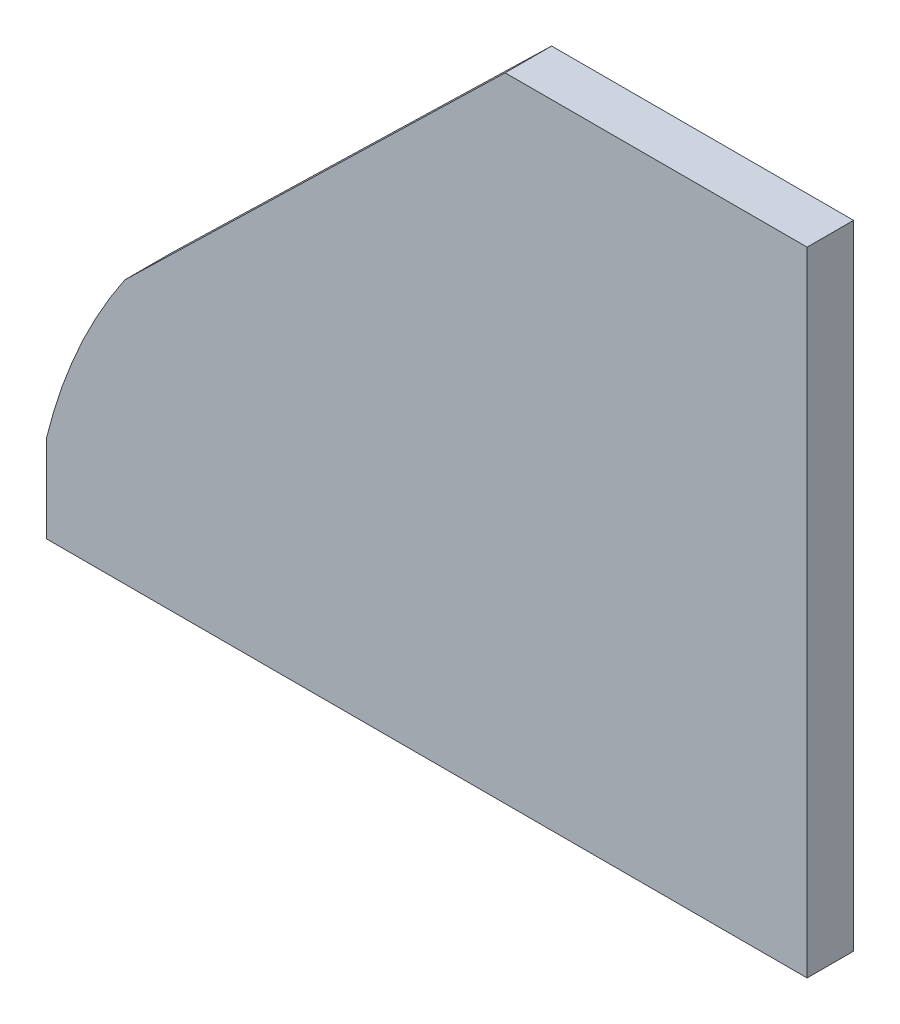
ISO-10303-21;
HEADER;
FILE_DESCRIPTION(('STEP AP214'),'2;1');
FILE_NAME('part.step','',(''),(''),'','','');
FILE_SCHEMA(('AUTOMOTIVE_DESIGN { 1 0 10303 214 1 1 1 1 }'));
ENDSEC;
DATA;
#1=APPLICATION_CONTEXT('core data for automotive mechanical design processes');
#2=APPLICATION_PROTOCOL_DEFINITION('international standard','automotive_design',2000,#1);
#3=PRODUCT_CONTEXT('',#1,'mechanical');
#4=PRODUCT('Part','Part','',(#3));
#5=PRODUCT_RELATED_PRODUCT_CATEGORY('part','',(#4));
#6=PRODUCT_DEFINITION_FORMATION('','',#4);
#7=PRODUCT_DEFINITION_CONTEXT('part definition',#1,'design');
#8=PRODUCT_DEFINITION('design','',#6,#7);
#9=PRODUCT_DEFINITION_SHAPE('','',#8);
#10=(LENGTH_UNIT() NAMED_UNIT(*) SI_UNIT(.MILLI.,.METRE.));
#11=(NAMED_UNIT(*) PLANE_ANGLE_UNIT() SI_UNIT($,.RADIAN.));
#12=(NAMED_UNIT(*) SI_UNIT($,.STERADIAN.) SOLID_ANGLE_UNIT());
#13=UNCERTAINTY_MEASURE_WITH_UNIT(LENGTH_MEASURE(1.E-05),#10,'distance_accuracy_value','');
#14=(GEOMETRIC_REPRESENTATION_CONTEXT(3) GLOBAL_UNCERTAINTY_ASSIGNED_CONTEXT((#13)) GLOBAL_UNIT_ASSIGNED_CONTEXT((#10,
#11,#12)) REPRESENTATION_CONTEXT('',''));
#15=CARTESIAN_POINT('',(0.,0.,0.));
#16=DIRECTION('',(0.,0.,1.));
#17=DIRECTION('',(1.,0.,0.));
#18=AXIS2_PLACEMENT_3D('',#15,#16,#17);
#19=CARTESIAN_POINT('',(90.3335679204065,-6.9645677662856,8.));
#20=DIRECTION('',(0.,0.,-1.));
#21=DIRECTION('',(-1.,0.,0.));
#22=AXIS2_PLACEMENT_3D('',#19,#20,#21);
#23=CYLINDRICAL_SURFACE('',#22,92.9655620667699);
#24=CARTESIAN_POINT('',(90.3335679204065,-6.9645677662856,0.));
#25=DIRECTION('',(0.,0.,1.));
#26=DIRECTION('',(1.,0.,0.));
#27=AXIS2_PLACEMENT_3D('',#24,#25,#26);
#28=CIRCLE('',#27,92.9655620667699);
#29=CARTESIAN_POINT('',(0.,15.,0.));
#30=VERTEX_POINT('',#29);
#31=CARTESIAN_POINT('',(13.510611656134,45.3883607211269,0.));
#32=VERTEX_POINT('',#31);
#33=EDGE_CURVE('E116',#30,#32,#28,.F.);
#34=ORIENTED_EDGE('',*,*,#33,.F.);
#35=DIRECTION('',(0.,0.,-1.));
#36=VECTOR('',#35,1.);
#37=CARTESIAN_POINT('',(0.,15.,8.));
#38=LINE('',#37,#36);
#39=CARTESIAN_POINT('',(0.,15.,8.));
#40=VERTEX_POINT('',#39);
#41=EDGE_CURVE('E11',#40,#30,#38,.T.);
#42=ORIENTED_EDGE('',*,*,#41,.F.);
#43=CARTESIAN_POINT('',(90.3335679204065,-6.9645677662856,8.));
#44=DIRECTION('',(0.,0.,1.));
#45=DIRECTION('',(1.,0.,0.));
#46=AXIS2_PLACEMENT_3D('',#43,#44,#45);
#47=CIRCLE('',#46,92.9655620667699);
#48=CARTESIAN_POINT('',(13.510611656134,45.3883607211269,8.));
#49=VERTEX_POINT('',#48);
#50=EDGE_CURVE('E129',#40,#49,#47,.F.);
#51=ORIENTED_EDGE('',*,*,#50,.T.);
#52=DIRECTION('',(0.,0.,-1.));
#53=VECTOR('',#52,1.);
#54=CARTESIAN_POINT('',(13.510611656134,45.3883607211269,8.));
#55=LINE('',#54,#53);
#56=EDGE_CURVE('E50',#49,#32,#55,.T.);
#57=ORIENTED_EDGE('',*,*,#56,.T.);
#58=EDGE_LOOP('',(#34,#42,#51,#57));
#59=FACE_BOUND('',#58,.T.);
#60=ADVANCED_FACE('F34',(#59),#23,.T.);
#61=CARTESIAN_POINT('',(0.,0.,8.));
#62=DIRECTION('',(-1.,0.,0.));
#63=DIRECTION('',(0.,0.,1.));
#64=AXIS2_PLACEMENT_3D('',#61,#62,#63);
#65=PLANE('',#64);
#66=DIRECTION('',(0.,1.,0.));
#67=VECTOR('',#66,1.);
#68=CARTESIAN_POINT('',(0.,0.,0.));
#69=LINE('',#68,#67);
#70=CARTESIAN_POINT('',(0.,0.,0.));
#71=VERTEX_POINT('',#70);
#72=EDGE_CURVE('E118',#71,#30,#69,.T.);
#73=ORIENTED_EDGE('',*,*,#72,.F.);
#74=DIRECTION('',(0.,0.,-1.));
#75=VECTOR('',#74,1.);
#76=CARTESIAN_POINT('',(0.,0.,8.));
#77=LINE('',#76,#75);
#78=CARTESIAN_POINT('',(0.,0.,8.));
#79=VERTEX_POINT('',#78);
#80=EDGE_CURVE('E42',#79,#71,#77,.T.);
#81=ORIENTED_EDGE('',*,*,#80,.F.);
#82=DIRECTION('',(0.,1.,0.));
#83=VECTOR('',#82,1.);
#84=CARTESIAN_POINT('',(0.,0.,8.));
#85=LINE('',#84,#83);
#86=EDGE_CURVE('E141',#79,#40,#85,.T.);
#87=ORIENTED_EDGE('',*,*,#86,.T.);
#88=ORIENTED_EDGE('',*,*,#41,.T.);
#89=EDGE_LOOP('',(#73,#81,#87,#88));
#90=FACE_BOUND('',#89,.T.);
#91=ADVANCED_FACE('F140',(#90),#65,.T.);
#92=CARTESIAN_POINT('',(0.,0.,8.));
#93=DIRECTION('',(0.,1.,0.));
#94=DIRECTION('',(0.,0.,1.));
#95=AXIS2_PLACEMENT_3D('',#92,#93,#94);
#96=PLANE('',#95);
#97=DIRECTION('',(1.,0.,0.));
#98=VECTOR('',#97,1.);
#99=CARTESIAN_POINT('',(0.,0.,0.));
#100=LINE('',#99,#98);
#101=CARTESIAN_POINT('',(131.,0.,0.));
#102=VERTEX_POINT('',#101);
#103=EDGE_CURVE('E121',#71,#102,#100,.T.);
#104=ORIENTED_EDGE('',*,*,#103,.T.);
#105=DIRECTION('',(0.,0.,-1.));
#106=VECTOR('',#105,1.);
#107=CARTESIAN_POINT('',(131.,0.,8.));
#108=LINE('',#107,#106);
#109=CARTESIAN_POINT('',(131.,0.,8.));
#110=VERTEX_POINT('',#109);
#111=EDGE_CURVE('E108',#110,#102,#108,.T.);
#112=ORIENTED_EDGE('',*,*,#111,.F.);
#113=DIRECTION('',(1.,0.,0.));
#114=VECTOR('',#113,1.);
#115=CARTESIAN_POINT('',(0.,0.,8.));
#116=LINE('',#115,#114);
#117=EDGE_CURVE('E96',#79,#110,#116,.T.);
#118=ORIENTED_EDGE('',*,*,#117,.F.);
#119=ORIENTED_EDGE('',*,*,#80,.T.);
#120=EDGE_LOOP('',(#104,#112,#118,#119));
#121=FACE_BOUND('',#120,.T.);
#122=ADVANCED_FACE('F134',(#121),#96,.F.);
#123=CARTESIAN_POINT('',(131.,0.,8.));
#124=DIRECTION('',(-1.,0.,0.));
#125=DIRECTION('',(0.,0.,1.));
#126=AXIS2_PLACEMENT_3D('',#123,#124,#125);
#127=PLANE('',#126);
#128=DIRECTION('',(0.,1.,0.));
#129=VECTOR('',#128,1.);
#130=CARTESIAN_POINT('',(131.,0.,0.));
#131=LINE('',#130,#129);
#132=CARTESIAN_POINT('',(131.,109.,0.));
#133=VERTEX_POINT('',#132);
#134=EDGE_CURVE('E105',#102,#133,#131,.T.);
#135=ORIENTED_EDGE('',*,*,#134,.T.);
#136=DIRECTION('',(0.,0.,-1.));
#137=VECTOR('',#136,1.);
#138=CARTESIAN_POINT('',(131.,109.,8.));
#139=LINE('',#138,#137);
#140=CARTESIAN_POINT('',(131.,109.,8.));
#141=VERTEX_POINT('',#140);
#142=EDGE_CURVE('E102',#141,#133,#139,.T.);
#143=ORIENTED_EDGE('',*,*,#142,.F.);
#144=DIRECTION('',(0.,1.,0.));
#145=VECTOR('',#144,1.);
#146=CARTESIAN_POINT('',(131.,0.,8.));
#147=LINE('',#146,#145);
#148=EDGE_CURVE('E88',#110,#141,#147,.T.);
#149=ORIENTED_EDGE('',*,*,#148,.F.);
#150=ORIENTED_EDGE('',*,*,#111,.T.);
#151=EDGE_LOOP('',(#135,#143,#149,#150));
#152=FACE_BOUND('',#151,.T.);
#153=ADVANCED_FACE('F103',(#152),#127,.F.);
#154=CARTESIAN_POINT('',(0.,109.,8.));
#155=DIRECTION('',(0.,-1.,0.));
#156=DIRECTION('',(1.,0.,0.));
#157=AXIS2_PLACEMENT_3D('',#154,#155,#156);
#158=PLANE('',#157);
#159=DIRECTION('',(-1.,0.,0.));
#160=VECTOR('',#159,1.);
#161=CARTESIAN_POINT('',(0.,109.,0.));
#162=LINE('',#161,#160);
#163=CARTESIAN_POINT('',(79.,109.,0.));
#164=VERTEX_POINT('',#163);
#165=EDGE_CURVE('E124',#133,#164,#162,.T.);
#166=ORIENTED_EDGE('',*,*,#165,.T.);
#167=DIRECTION('',(0.,0.,-1.));
#168=VECTOR('',#167,1.);
#169=CARTESIAN_POINT('',(79.,109.,8.));
#170=LINE('',#169,#168);
#171=CARTESIAN_POINT('',(79.,109.,8.));
#172=VERTEX_POINT('',#171);
#173=EDGE_CURVE('E70',#172,#164,#170,.T.);
#174=ORIENTED_EDGE('',*,*,#173,.F.);
#175=DIRECTION('',(-1.,0.,0.));
#176=VECTOR('',#175,1.);
#177=CARTESIAN_POINT('',(0.,109.,8.));
#178=LINE('',#177,#176);
#179=EDGE_CURVE('E93',#141,#172,#178,.T.);
#180=ORIENTED_EDGE('',*,*,#179,.F.);
#181=ORIENTED_EDGE('',*,*,#142,.T.);
#182=EDGE_LOOP('',(#166,#174,#180,#181));
#183=FACE_BOUND('',#182,.T.);
#184=ADVANCED_FACE('F110',(#183),#158,.F.);
#185=CARTESIAN_POINT('',(-16.1257422237104,16.6017572694812,8.));
#186=DIRECTION('',(-0.696748356959213,0.717315639781148,0.));
#187=DIRECTION('',(-0.717315639781148,-0.696748356959213,0.));
#188=AXIS2_PLACEMENT_3D('',#185,#186,#187);
#189=PLANE('',#188);
#190=DIRECTION('',(0.717315639781148,0.696748356959213,0.));
#191=VECTOR('',#190,1.);
#192=CARTESIAN_POINT('',(-16.1257422237104,16.6017572694812,0.));
#193=LINE('',#192,#191);
#194=EDGE_CURVE('E126',#32,#164,#193,.T.);
#195=ORIENTED_EDGE('',*,*,#194,.F.);
#196=ORIENTED_EDGE('',*,*,#56,.F.);
#197=DIRECTION('',(0.717315639781148,0.696748356959213,0.));
#198=VECTOR('',#197,1.);
#199=CARTESIAN_POINT('',(-16.1257422237104,16.6017572694812,8.));
#200=LINE('',#199,#198);
#201=EDGE_CURVE('E111',#49,#172,#200,.T.);
#202=ORIENTED_EDGE('',*,*,#201,.T.);
#203=ORIENTED_EDGE('',*,*,#173,.T.);
#204=EDGE_LOOP('',(#195,#196,#202,#203));
#205=FACE_BOUND('',#204,.T.);
#206=ADVANCED_FACE('F142',(#205),#189,.T.);
#207=CARTESIAN_POINT('',(0.,0.,8.));
#208=DIRECTION('',(0.,0.,1.));
#209=DIRECTION('',(1.,0.,0.));
#210=AXIS2_PLACEMENT_3D('',#207,#208,#209);
#211=PLANE('',#210);
#212=ORIENTED_EDGE('',*,*,#50,.F.);
#213=ORIENTED_EDGE('',*,*,#86,.F.);
#214=ORIENTED_EDGE('',*,*,#117,.T.);
#215=ORIENTED_EDGE('',*,*,#148,.T.);
#216=ORIENTED_EDGE('',*,*,#179,.T.);
#217=ORIENTED_EDGE('',*,*,#201,.F.);
#218=EDGE_LOOP('',(#212,#213,#214,#215,#216,#217));
#219=FACE_BOUND('',#218,.T.);
#220=ADVANCED_FACE('F90',(#219),#211,.T.);
#221=CARTESIAN_POINT('',(0.,0.,0.));
#222=DIRECTION('',(0.,0.,1.));
#223=DIRECTION('',(1.,0.,0.));
#224=AXIS2_PLACEMENT_3D('',#221,#222,#223);
#225=PLANE('',#224);
#226=ORIENTED_EDGE('',*,*,#33,.T.);
#227=ORIENTED_EDGE('',*,*,#194,.T.);
#228=ORIENTED_EDGE('',*,*,#165,.F.);
#229=ORIENTED_EDGE('',*,*,#134,.F.);
#230=ORIENTED_EDGE('',*,*,#103,.F.);
#231=ORIENTED_EDGE('',*,*,#72,.T.);
#232=EDGE_LOOP('',(#226,#227,#228,#229,#230,#231));
#233=FACE_BOUND('',#232,.T.);
#234=ADVANCED_FACE('F139',(#233),#225,.F.);
#235=CLOSED_SHELL('',(#60,#91,#122,#153,#184,#206,#220,#234));
#236=MANIFOLD_SOLID_BREP('B2',#235);
#237=ADVANCED_BREP_SHAPE_REPRESENTATION('',(#18,#236),#14);
#238=SHAPE_DEFINITION_REPRESENTATION(#9,#237);
ENDSEC;
END-ISO-10303-21;
